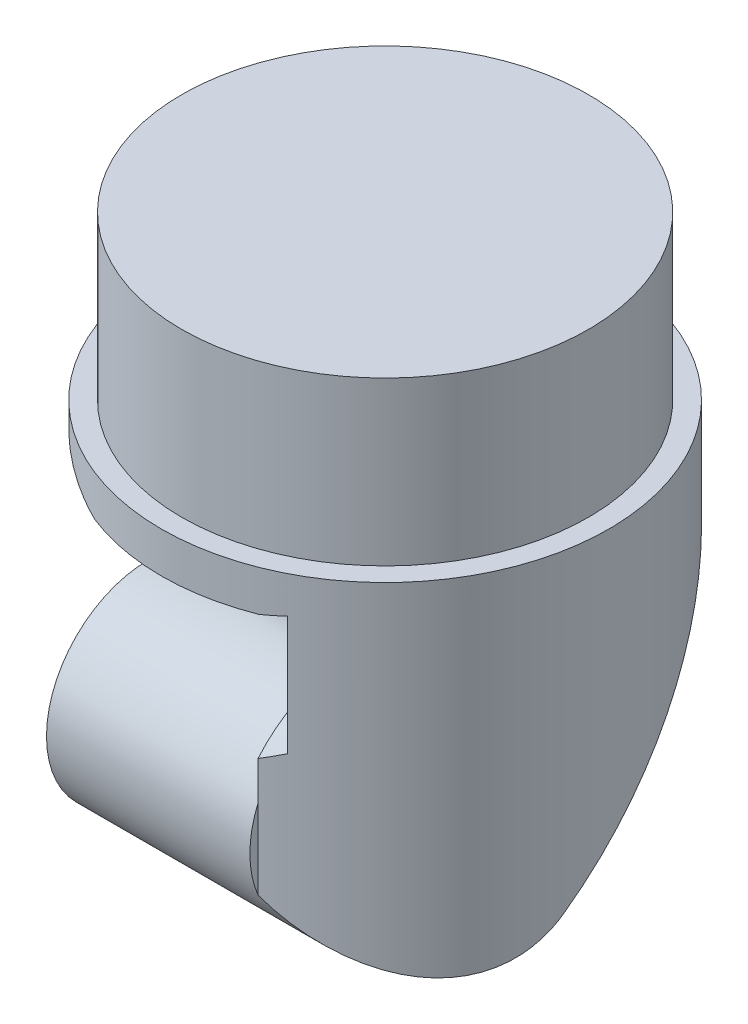
ISO-10303-21;
HEADER;
FILE_DESCRIPTION(('STEP AP214'),'2;1');
FILE_NAME('part.step','',(''),(''),'','','');
FILE_SCHEMA(('AUTOMOTIVE_DESIGN { 1 0 10303 214 1 1 1 1 }'));
ENDSEC;
DATA;
#1=APPLICATION_CONTEXT('core data for automotive mechanical design processes');
#2=APPLICATION_PROTOCOL_DEFINITION('international standard','automotive_design',2000,#1);
#3=PRODUCT_CONTEXT('',#1,'mechanical');
#4=PRODUCT('Part','Part','',(#3));
#5=PRODUCT_RELATED_PRODUCT_CATEGORY('part','',(#4));
#6=PRODUCT_DEFINITION_FORMATION('','',#4);
#7=PRODUCT_DEFINITION_CONTEXT('part definition',#1,'design');
#8=PRODUCT_DEFINITION('design','',#6,#7);
#9=PRODUCT_DEFINITION_SHAPE('','',#8);
#10=(LENGTH_UNIT() NAMED_UNIT(*) SI_UNIT(.MILLI.,.METRE.));
#11=(NAMED_UNIT(*) PLANE_ANGLE_UNIT() SI_UNIT($,.RADIAN.));
#12=(NAMED_UNIT(*) SI_UNIT($,.STERADIAN.) SOLID_ANGLE_UNIT());
#13=UNCERTAINTY_MEASURE_WITH_UNIT(LENGTH_MEASURE(1.E-05),#10,'distance_accuracy_value','');
#14=(GEOMETRIC_REPRESENTATION_CONTEXT(3) GLOBAL_UNCERTAINTY_ASSIGNED_CONTEXT((#13)) GLOBAL_UNIT_ASSIGNED_CONTEXT((#10,
#11,#12)) REPRESENTATION_CONTEXT('',''));
#15=CARTESIAN_POINT('',(0.,0.,0.));
#16=DIRECTION('',(0.,0.,1.));
#17=DIRECTION('',(1.,0.,0.));
#18=AXIS2_PLACEMENT_3D('',#15,#16,#17);
#19=CARTESIAN_POINT('',(0.,10.,0.));
#20=DIRECTION('',(0.,1.,0.));
#21=DIRECTION('',(0.,0.,1.));
#22=AXIS2_PLACEMENT_3D('',#19,#20,#21);
#23=CYLINDRICAL_SURFACE('',#22,5.5);
#24=CARTESIAN_POINT('',(0.,11.,0.));
#25=DIRECTION('',(0.,1.,0.));
#26=DIRECTION('',(0.,0.,1.));
#27=AXIS2_PLACEMENT_3D('',#24,#25,#26);
#28=CIRCLE('',#27,5.5);
#29=CARTESIAN_POINT('',(0.,11.,5.5));
#30=VERTEX_POINT('',#29);
#31=EDGE_CURVE('E243',#30,#30,#28,.T.);
#32=ORIENTED_EDGE('',*,*,#31,.F.);
#33=EDGE_LOOP('',(#32));
#34=FACE_BOUND('',#33,.T.);
#35=DIRECTION('',(0.,1.,0.));
#36=VECTOR('',#35,1.);
#37=CARTESIAN_POINT('',(2.5,10.,4.89897948556636));
#38=LINE('',#37,#36);
#39=CARTESIAN_POINT('',(2.5,10.0936873271116,4.89897948556636));
#40=VERTEX_POINT('',#39);
#41=CARTESIAN_POINT('',(2.5,7.16694498923648,4.89897948556636));
#42=VERTEX_POINT('',#41);
#43=EDGE_CURVE('E133',#40,#42,#38,.F.);
#44=ORIENTED_EDGE('',*,*,#43,.T.);
#45=CARTESIAN_POINT('',(2.5,7.16694498923648,4.89897948556636));
#46=CARTESIAN_POINT('',(2.45925598721561,7.14703912892889,4.91977108116387));
#47=CARTESIAN_POINT('',(2.41828211998175,7.12705867983323,4.94004032045465));
#48=CARTESIAN_POINT('',(2.33589147481019,7.08703747639836,4.97952788782191));
#49=CARTESIAN_POINT('',(2.29447493901794,7.0669967589463,4.99874675848738));
#50=CARTESIAN_POINT('',(2.2111732511241,7.02692295730909,5.03614907488732));
#51=CARTESIAN_POINT('',(2.16928809887176,7.00688987312639,5.05433252028873));
#52=CARTESIAN_POINT('',(2.08501704036061,6.96690876905985,5.08967496151173));
#53=CARTESIAN_POINT('',(2.04263088419465,6.94696079902124,5.10683341778357));
#54=CARTESIAN_POINT('',(2.,6.92710462120812,5.1234753829798));
#55=B_SPLINE_CURVE_WITH_KNOTS('',3,(#45,#46,#47,#48,#49,#50,#51,#52,#53,#54),.UNSPECIFIED.,.F.,
.F.,(4,2,2,2,4),(0.,0.149654235637309,0.299230419138411,0.448806650752238,0.598460937130687),.UNSPECIFIED.);
#56=CARTESIAN_POINT('',(2.,6.92710462120812,5.1234753829798));
#57=VERTEX_POINT('',#56);
#58=EDGE_CURVE('E166',#42,#57,#55,.T.);
#59=ORIENTED_EDGE('',*,*,#58,.T.);
#60=DIRECTION('',(0.,1.,0.));
#61=VECTOR('',#60,1.);
#62=CARTESIAN_POINT('',(2.,2.5,5.1234753829798));
#63=LINE('',#62,#61);
#64=CARTESIAN_POINT('',(2.,5.98169864066408,5.1234753829798));
#65=VERTEX_POINT('',#64);
#66=EDGE_CURVE('E125',#65,#57,#63,.T.);
#67=ORIENTED_EDGE('',*,*,#66,.F.);
#68=DIRECTION('',(0.,1.,0.));
#69=VECTOR('',#68,1.);
#70=CARTESIAN_POINT('',(2.,2.5,5.1234753829798));
#71=LINE('',#70,#69);
#72=CARTESIAN_POINT('',(2.,4.01830135933592,5.1234753829798));
#73=VERTEX_POINT('',#72);
#74=EDGE_CURVE('E195',#73,#65,#71,.T.);
#75=ORIENTED_EDGE('',*,*,#74,.F.);
#76=CARTESIAN_POINT('',(2.,4.01830135933592,5.1234753829798));
#77=CARTESIAN_POINT('',(2.0520121023461,3.97081184600082,5.10317961151804));
#78=CARTESIAN_POINT('',(2.10466473352652,3.92455261326593,5.08170628777884));
#79=CARTESIAN_POINT('',(2.21082294492664,3.83422853487849,5.03642427603247));
#80=CARTESIAN_POINT('',(2.26432834491247,3.79016323344603,5.01261607616378));
#81=CARTESIAN_POINT('',(2.37182114089697,3.70391309061592,4.96265925620459));
#82=CARTESIAN_POINT('',(2.42580882898598,3.66172949671099,4.93650911706318));
#83=CARTESIAN_POINT('',(2.53397167715478,3.57915479195713,4.8818704506749));
#84=CARTESIAN_POINT('',(2.58814684946937,3.53876380056137,4.85338176795451));
#85=CARTESIAN_POINT('',(2.75171697712417,3.41938525955828,4.76378061266119));
#86=CARTESIAN_POINT('',(2.86108335697951,3.34304321951705,4.69902638504962));
#87=CARTESIAN_POINT('',(3.07831395721625,3.19762515146659,4.55967544289563));
#88=CARTESIAN_POINT('',(3.18617867531005,3.12854666375361,4.48508207965968));
#89=CARTESIAN_POINT('',(3.37438667691193,3.01369066638822,4.34441101682515));
#90=CARTESIAN_POINT('',(3.45526985484804,2.96624078531022,4.28041804791778));
#91=CARTESIAN_POINT('',(3.61499221951131,2.87667908368489,4.14640781963944));
#92=CARTESIAN_POINT('',(3.69383150338769,2.83456700905252,4.07639084728374));
#93=CARTESIAN_POINT('',(3.84865389629679,2.75656011838206,3.93053828654509));
#94=CARTESIAN_POINT('',(3.92464549684633,2.72064543529278,3.8547224599004));
#95=CARTESIAN_POINT('',(4.07338478598405,2.65579867424649,3.69719859308611));
#96=CARTESIAN_POINT('',(4.14613337102933,2.62686465676455,3.61549219777975));
#97=CARTESIAN_POINT('',(4.32349999814032,2.5644435456329,3.4036510421814));
#98=CARTESIAN_POINT('',(4.42568065729982,2.53602344308696,3.26987972386732));
#99=CARTESIAN_POINT('',(4.6184067694868,2.50166787686435,2.9914685962761));
#100=CARTESIAN_POINT('',(4.70896382735247,2.49570981606252,2.84683985923107));
#101=CARTESIAN_POINT('',(4.86266363720734,2.50942872032696,2.5739207064272));
#102=CARTESIAN_POINT('',(4.92787879538119,2.52524007351472,2.44661520870865));
#103=CARTESIAN_POINT('',(5.046741790139,2.57804192512723,2.19094279173464));
#104=CARTESIAN_POINT('',(5.10039465726541,2.61502318719868,2.0625763594172));
#105=CARTESIAN_POINT('',(5.19572009656008,2.71135918597005,1.80911853617226));
#106=CARTESIAN_POINT('',(5.23734347692325,2.77080355802562,1.68404244228337));
#107=CARTESIAN_POINT('',(5.30878996404733,2.91150908539301,1.44310792867163));
#108=CARTESIAN_POINT('',(5.33861374825384,2.99276898776855,1.32724898007363));
#109=CARTESIAN_POINT('',(5.38627302751153,3.16852206047862,1.11751273614817));
#110=CARTESIAN_POINT('',(5.40480897093367,3.26166724640532,1.02265905854441));
#111=CARTESIAN_POINT('',(5.43487448860407,3.46248305273733,0.848507024305077));
#112=CARTESIAN_POINT('',(5.44640390177997,3.57015400700439,0.769209025305639));
#113=CARTESIAN_POINT('',(5.46450828399156,3.79824929599975,0.627929575460576));
#114=CARTESIAN_POINT('',(5.4710300634636,3.91879546204354,0.566138313960116));
#115=CARTESIAN_POINT('',(5.48074210187755,4.16839391427828,0.462786590747274));
#116=CARTESIAN_POINT('',(5.48393197588867,4.29744718145323,0.421228466839519));
#117=CARTESIAN_POINT('',(5.48838928467269,4.56432877202035,0.358622624370073));
#118=CARTESIAN_POINT('',(5.48959989706327,4.70230197539615,0.338187140200632));
#119=CARTESIAN_POINT('',(5.49066067733322,4.97973626582963,0.320506826700593));
#120=CARTESIAN_POINT('',(5.49051073679346,5.119197470578,0.323263845522439));
#121=CARTESIAN_POINT('',(5.48874178413259,5.39697269081984,0.352024287980783));
#122=CARTESIAN_POINT('',(5.48710952416477,5.53526498950838,0.378237312569402));
#123=CARTESIAN_POINT('',(5.48140460885704,5.8054698510478,0.453446359908798));
#124=CARTESIAN_POINT('',(5.47733183586814,5.93738210600675,0.502443480979214));
#125=CARTESIAN_POINT('',(5.46508775128994,6.19065577805727,0.621591081499012));
#126=CARTESIAN_POINT('',(5.45692748585514,6.31204460234463,0.691684347450708));
#127=CARTESIAN_POINT('',(5.43438566114513,6.54104780450643,0.850812970663726));
#128=CARTESIAN_POINT('',(5.42000538317617,6.64866501338413,0.939844424789315));
#129=CARTESIAN_POINT('',(5.38318518818132,6.84482811489809,1.13164752097222));
#130=CARTESIAN_POINT('',(5.36092060598035,6.93372661035177,1.23409187931157));
#131=CARTESIAN_POINT('',(5.30652822323819,7.09282989655711,1.45022097449946));
#132=CARTESIAN_POINT('',(5.27440358867859,7.16304067428881,1.56390209538415));
#133=CARTESIAN_POINT('',(5.20026182217657,7.28182731756178,1.79487683031511));
#134=CARTESIAN_POINT('',(5.15853296357643,7.33093269552427,1.91199191134318));
#135=CARTESIAN_POINT('',(5.06463442900662,7.41013303448276,2.14840812717182));
#136=CARTESIAN_POINT('',(5.01246310396729,7.44022498976366,2.26770960454048));
#137=CARTESIAN_POINT('',(4.89627817336472,7.48317393873218,2.50899106059221));
#138=CARTESIAN_POINT('',(4.83190587816689,7.49537151884175,2.63091286407813));
#139=CARTESIAN_POINT('',(4.69390473187341,7.50244465164925,2.86989909759627));
#140=CARTESIAN_POINT('',(4.62027191445891,7.49731275757164,2.98696141754587));
#141=CARTESIAN_POINT('',(4.48697610250427,7.47560608812503,3.18227578733768));
#142=CARTESIAN_POINT('',(4.42915825983943,7.46262918851517,3.26223281460293));
#143=CARTESIAN_POINT('',(4.31005246068323,7.42977039833765,3.41805131023414));
#144=CARTESIAN_POINT('',(4.24876329062628,7.40988608033042,3.49391132796512));
#145=CARTESIAN_POINT('',(4.06021423213746,7.34100294520247,3.71512766004203));
#146=CARTESIAN_POINT('',(3.92843465987049,7.2828044793812,3.8538852487387));
#147=CARTESIAN_POINT('',(3.70006470537728,7.16903966737324,4.07135766727));
#148=CARTESIAN_POINT('',(3.60560033846919,7.1185145670461,4.15514011248343));
#149=CARTESIAN_POINT('',(3.41375408402635,7.00987854551243,4.31413751136257));
#150=CARTESIAN_POINT('',(3.31637093710724,6.95176431238632,4.38934869751328));
#151=CARTESIAN_POINT('',(3.11963170077265,6.82891861747026,4.53129421940561));
#152=CARTESIAN_POINT('',(3.02027519382033,6.7641857429822,4.59802673859578));
#153=CARTESIAN_POINT('',(2.82050739667142,6.62869263541682,4.72319950823664));
#154=CARTESIAN_POINT('',(2.72009646309154,6.55793438605319,4.78164247106751));
#155=CARTESIAN_POINT('',(2.56732090792769,6.44575464389353,4.86440295454278));
#156=CARTESIAN_POINT('',(2.51494638625815,6.40648845046464,4.89167282868759));
#157=CARTESIAN_POINT('',(2.41040736105154,6.32627903206657,4.94402188329289));
#158=CARTESIAN_POINT('',(2.35824280466936,6.28533626236895,4.96910165275369));
#159=CARTESIAN_POINT('',(2.2545689683448,6.2018235730392,5.01698705386687));
#160=CARTESIAN_POINT('',(2.20305787308151,6.15926106135217,5.03980163883733));
#161=CARTESIAN_POINT('',(2.10083144889821,6.07208103636492,5.08326789170887));
#162=CARTESIAN_POINT('',(2.05011645412991,6.02746268952877,5.10391867098747));
#163=CARTESIAN_POINT('',(2.,5.98169864066408,5.1234753829798));
#164=B_SPLINE_CURVE_WITH_KNOTS('',3,(#76,#77,#78,#79,#80,#81,#82,#83,#84,#85,#86,#87,#88,#89,
#90,#91,#92,#93,#94,#95,#96,#97,#98,#99,#100,#101,#102,#103,#104,#105,#106,#107,#108,#109,#110,
#111,#112,#113,#114,#115,#116,#117,#118,#119,#120,#121,#122,#123,#124,#125,#126,#127,#128,#129,
#130,#131,#132,#133,#134,#135,#136,#137,#138,#139,#140,#141,#142,#143,#144,#145,#146,#147,#148,
#149,#150,#151,#152,#153,#154,#155,#156,#157,#158,#159,#160,#161,#162,#163),.UNSPECIFIED.,.F.,
.F.,(4,2,2,2,2,2,2,2,2,2,2,2,2,2,2,2,2,2,2,2,2,2,2,2,2,2,2,2,2,2,2,2,2,2,2,2,2,2,2,2,2,2,2,4),
(0.,0.219843913654683,0.439641963452114,0.659583627849797,0.879539926501751,1.32380750826896,
1.76792415700312,2.10823602717482,2.44853169206527,2.78771533946555,3.12680463845527,
3.63696069988687,4.14660340009105,4.57649437937514,5.0061979416025,5.43763458853796,
5.86904646197417,6.26984914697785,6.67066104564137,7.07567350769213,7.48073275514285,
7.89722871449102,8.31375786367287,8.73404666803513,9.15435573474613,9.57353502541831,
9.99262800734981,10.4029325805433,10.8131055458991,11.2122830076563,11.6115235571466,
12.0251358566051,12.4389259150548,12.7370996568197,13.0353782904775,13.6327858348749,
14.0403394813645,14.4480715835516,14.8558908954177,15.2635764576096,15.4762698174481,
15.6889057988556,15.9006647342348,16.1125102958076),.UNSPECIFIED.);
#165=CARTESIAN_POINT('',(5.40294893955143,3.2605384485999,1.02866066154008));
#166=VERTEX_POINT('',#165);
#167=EDGE_CURVE('E67',#73,#166,#164,.T.);
#168=ORIENTED_EDGE('',*,*,#167,.T.);
#169=CARTESIAN_POINT('',(0.,4.32241305616325,0.));
#170=DIRECTION('',(0.,0.695784620560041,0.718250486802563));
#171=DIRECTION('',(0.,0.718250486802563,-0.695784620560041));
#172=AXIS2_PLACEMENT_3D('',#169,#170,#171);
#173=ELLIPSE('',#172,7.90474499935486,5.5);
#174=CARTESIAN_POINT('',(2.5,9.37957341350427,-4.89897948556636));
#175=VERTEX_POINT('',#174);
#176=EDGE_CURVE('E199',#166,#175,#173,.T.);
#177=ORIENTED_EDGE('',*,*,#176,.T.);
#178=DIRECTION('',(0.,1.,0.));
#179=VECTOR('',#178,1.);
#180=CARTESIAN_POINT('',(2.5,10.,-4.89897948556636));
#181=LINE('',#180,#179);
#182=CARTESIAN_POINT('',(2.5,10.,-4.89897948556636));
#183=VERTEX_POINT('',#182);
#184=EDGE_CURVE('E248',#175,#183,#181,.T.);
#185=ORIENTED_EDGE('',*,*,#184,.T.);
#186=CARTESIAN_POINT('',(0.,10.,0.));
#187=DIRECTION('',(0.,1.,0.));
#188=DIRECTION('',(0.,0.,1.));
#189=AXIS2_PLACEMENT_3D('',#186,#187,#188);
#190=CIRCLE('',#189,5.5);
#191=CARTESIAN_POINT('',(-5.47411289917188,10.,0.53299903106857));
#192=VERTEX_POINT('',#191);
#193=EDGE_CURVE('E138',#183,#192,#190,.T.);
#194=ORIENTED_EDGE('',*,*,#193,.T.);
#195=CARTESIAN_POINT('',(-5.10681537111245,2.43725756519353,-2.04216472532693));
#196=CARTESIAN_POINT('',(-5.08020430604462,2.56356196505974,-2.10868132075415));
#197=CARTESIAN_POINT('',(-5.05405536695922,2.69255608499536,-2.17032735134272));
#198=CARTESIAN_POINT('',(-5.00392289693016,2.95539053976743,-2.28355559375387));
#199=CARTESIAN_POINT('',(-4.97994075268291,3.08923390231833,-2.33513138503554));
#200=CARTESIAN_POINT('',(-4.93537285230333,3.36135969588435,-2.42790925125743));
#201=CARTESIAN_POINT('',(-4.91479440513671,3.49965093710599,-2.46908909958056));
#202=CARTESIAN_POINT('',(-4.87823955649087,3.77959648121641,-2.54055019204561));
#203=CARTESIAN_POINT('',(-4.86226215779971,3.92125004815382,-2.57083379814882));
#204=CARTESIAN_POINT('',(-4.8357885402962,4.20769131780466,-2.62029447097012));
#205=CARTESIAN_POINT('',(-4.82531838861904,4.35249060666159,-2.63941876377057));
#206=CARTESIAN_POINT('',(-4.81063387237329,4.64348026091571,-2.66609007427546));
#207=CARTESIAN_POINT('',(-4.80641977304448,4.78967068502885,-2.67363660111423));
#208=CARTESIAN_POINT('',(-4.8045250016229,5.08191304576903,-2.67704004188268));
#209=CARTESIAN_POINT('',(-4.80683016951952,5.22796459434139,-2.67292229088259));
#210=CARTESIAN_POINT('',(-4.81779291382502,5.51902961494171,-2.65311099060148));
#211=CARTESIAN_POINT('',(-4.82645024214845,5.66404312728714,-2.6374178933988));
#212=CARTESIAN_POINT('',(-4.84879500105589,5.94229906714845,-2.59609266102515));
#213=CARTESIAN_POINT('',(-4.86210830760555,6.07568135349662,-2.57119347247858));
#214=CARTESIAN_POINT('',(-4.89307769511641,6.33978361682317,-2.5117531189474));
#215=CARTESIAN_POINT('',(-4.91073531221675,6.47050263433306,-2.47720854278985));
#216=CARTESIAN_POINT('',(-4.96897982604749,6.85788961526392,-2.35944479474898));
#217=CARTESIAN_POINT('',(-5.01482202720051,7.10960867539478,-2.26212257421958));
#218=CARTESIAN_POINT('',(-5.11650354952537,7.61648847258106,-2.02230845854569));
#219=CARTESIAN_POINT('',(-5.17286739594837,7.87000739474562,-1.87659847610155));
#220=CARTESIAN_POINT('',(-5.28098352809626,8.35143609934559,-1.54641202162763));
#221=CARTESIAN_POINT('',(-5.33273780216239,8.57935693470897,-1.36195238073326));
#222=CARTESIAN_POINT('',(-5.41560360534169,8.98307424785209,-0.977625219157533));
#223=CARTESIAN_POINT('',(-5.44827816763928,9.16181381486586,-0.781227061876756));
#224=CARTESIAN_POINT('',(-5.48107521792518,9.40789611837603,-0.467849215772096));
#225=CARTESIAN_POINT('',(-5.48930513099088,9.48626915052163,-0.360230690406007));
#226=CARTESIAN_POINT('',(-5.49934213138561,9.63511098202684,-0.139400534836147));
#227=CARTESIAN_POINT('',(-5.50115224644876,9.70558349227538,-0.026191566772717));
#228=CARTESIAN_POINT('',(-5.49737906292621,9.8386276194784,0.205941357842611));
#229=CARTESIAN_POINT('',(-5.49173336157139,9.90112768786096,0.324905419720983));
#230=CARTESIAN_POINT('',(-5.47208556150758,10.0170237682701,0.566539823951086));
#231=CARTESIAN_POINT('',(-5.45808342390724,10.0704197379241,0.689210183549627));
#232=CARTESIAN_POINT('',(-5.42106900012991,10.1677105788751,0.936841028597795));
#233=CARTESIAN_POINT('',(-5.39806319183114,10.2116122458669,1.06179980612253));
#234=CARTESIAN_POINT('',(-5.34261373963774,10.2898115444072,1.31261781863084));
#235=CARTESIAN_POINT('',(-5.31017135490256,10.3241104560915,1.43847693129511));
#236=CARTESIAN_POINT('',(-5.24076779771461,10.379195592279,1.67247108960312));
#237=CARTESIAN_POINT('',(-5.2050224016436,10.4011855150805,1.78068727373288));
#238=CARTESIAN_POINT('',(-5.12641486104944,10.4383286856045,1.99574014998995));
#239=CARTESIAN_POINT('',(-5.08355041779562,10.453479719165,2.10257638448496));
#240=CARTESIAN_POINT('',(-4.99090667131471,10.4773002259817,2.31390574041743));
#241=CARTESIAN_POINT('',(-4.94112917846329,10.4859713923913,2.41839946701233));
#242=CARTESIAN_POINT('',(-4.8349116319814,10.497331451411,2.62432063989886));
#243=CARTESIAN_POINT('',(-4.7784689711578,10.5000179948176,2.72574686666951));
#244=CARTESIAN_POINT('',(-4.65897896818806,10.4999817334464,2.9253217674607));
#245=CARTESIAN_POINT('',(-4.59589968591847,10.4972315196022,3.02345128474291));
#246=CARTESIAN_POINT('',(-4.46375700540589,10.4869222231001,3.21534833118504));
#247=CARTESIAN_POINT('',(-4.3946915089416,10.479361448362,3.30911431304383));
#248=CARTESIAN_POINT('',(-4.17913850316496,10.4504922047231,3.58311685890664));
#249=CARTESIAN_POINT('',(-4.02422277012943,10.4229952020377,3.75617742305803));
#250=CARTESIAN_POINT('',(-3.66924957482984,10.3520322500745,4.10587313923884));
#251=CARTESIAN_POINT('',(-3.46592470195342,10.3067342273302,4.27878483868033));
#252=CARTESIAN_POINT('',(-3.03704935905655,10.2103902290551,4.59315566997598));
#253=CARTESIAN_POINT('',(-2.81146985301762,10.1593367315289,4.73457290591256));
#254=CARTESIAN_POINT('',(-2.4401526321849,10.0809230584823,4.93148937001724));
#255=CARTESIAN_POINT('',(-2.30044749451627,10.0525779998852,4.99819562985277));
#256=CARTESIAN_POINT('',(-2.01549157112082,9.99853054546607,5.11974240101632));
#257=CARTESIAN_POINT('',(-1.87024278916417,9.97282720696067,5.17458715282773));
#258=CARTESIAN_POINT('',(-1.5751492464924,9.92565471759119,5.27190861088218));
#259=CARTESIAN_POINT('',(-1.425309263666,9.90418132686962,5.31439772227169));
#260=CARTESIAN_POINT('',(-1.12190024005986,9.8668389207465,5.38661735793425));
#261=CARTESIAN_POINT('',(-0.968331684668656,9.85096917999392,5.4163495336055));
#262=CARTESIAN_POINT('',(-0.664500662140752,9.82640935622664,5.46178878438238));
#263=CARTESIAN_POINT('',(-0.514331064397189,9.81747170381334,5.47798126811434));
#264=CARTESIAN_POINT('',(-0.212906196747802,9.80641698203324,5.49795267692685));
#265=CARTESIAN_POINT('',(-0.0616508893626007,9.80430014927132,5.50173117138324));
#266=CARTESIAN_POINT('',(0.240676806268429,9.80703837981312,5.49681190145337));
#267=CARTESIAN_POINT('',(0.391749051448715,9.81189721224604,5.48810739218571));
#268=CARTESIAN_POINT('',(0.6922458274278,9.82824887550451,5.45835117202347));
#269=CARTESIAN_POINT('',(0.841670782562247,9.83973995517377,5.43730272035838));
#270=CARTESIAN_POINT('',(1.16324240418514,9.87108196540106,5.3784722118344));
#271=CARTESIAN_POINT('',(1.33487672311458,9.89203082192907,5.33843470734912));
#272=CARTESIAN_POINT('',(1.58791336625386,9.92810457565738,5.26651755744414));
#273=CARTESIAN_POINT('',(1.67141279694265,9.94088376208905,5.24061151021068));
#274=CARTESIAN_POINT('',(1.83688082969412,9.96772852182612,5.1849280841318));
#275=CARTESIAN_POINT('',(1.91884975660574,9.98179381833009,5.15515153773085));
#276=CARTESIAN_POINT('',(2.,9.99637190580142,5.1234753829798));
#277=B_SPLINE_CURVE_WITH_KNOTS('',3,(#195,#196,#197,#198,#199,#200,#201,#202,#203,#204,#205,
#206,#207,#208,#209,#210,#211,#212,#213,#214,#215,#216,#217,#218,#219,#220,#221,#222,#223,#224,
#225,#226,#227,#228,#229,#230,#231,#232,#233,#234,#235,#236,#237,#238,#239,#240,#241,#242,#243,
#244,#245,#246,#247,#248,#249,#250,#251,#252,#253,#254,#255,#256,#257,#258,#259,#260,#261,#262,
#263,#264,#265,#266,#267,#268,#269,#270,#271,#272,#273,#274,#275,#276),.UNSPECIFIED.,.F.,.F.,(4,
2,2,2,2,2,2,2,2,2,2,2,2,2,2,2,2,2,2,2,2,2,2,2,2,2,2,2,2,2,2,2,2,2,2,2,2,2,2,2,4),(0.,
0.435555127145192,0.87138705333988,1.3081430475722,1.74480430977542,2.18351420818627,
2.62224270618453,3.06001900729658,3.49777821183941,3.90633174942853,4.31502995884403,
5.13296513216958,6.02278585582151,6.91222087696472,7.71129220753601,8.11102701843365,
8.51057327950509,8.91348489848849,9.31639839266151,9.71902253368035,10.1215929756043,
10.4693786386591,10.8172768203479,11.1650840663489,11.5130278165357,11.8627301767408,
12.2125556102908,12.9117927189973,13.7210699498596,14.5314173857799,15.0030970398564,
15.474607788922,15.9456434904817,16.4166181975842,16.8698803003826,17.3231581260522,
17.7766809614484,18.2300841049433,18.7614709139767,19.0264462634075,19.2913647174849),.UNSPECIFIED.);
#278=CARTESIAN_POINT('',(-2.02012257609788,10.,5.11557472602441));
#279=VERTEX_POINT('',#278);
#280=EDGE_CURVE('E120',#192,#279,#277,.T.);
#281=ORIENTED_EDGE('',*,*,#280,.T.);
#282=CARTESIAN_POINT('',(2.,10.,5.1234753829798));
#283=VERTEX_POINT('',#282);
#284=EDGE_CURVE('E277',#279,#283,#190,.T.);
#285=ORIENTED_EDGE('',*,*,#284,.T.);
#286=CARTESIAN_POINT('',(2.,9.99637190580142,5.1234753829798));
#287=VERTEX_POINT('',#286);
#288=EDGE_CURVE('E257',#287,#283,#63,.T.);
#289=ORIENTED_EDGE('',*,*,#288,.F.);
#290=CARTESIAN_POINT('',(2.5,10.0936873271116,4.89897948556636));
#291=CARTESIAN_POINT('',(2.45934208972774,10.0852363866161,4.91972763595864));
#292=CARTESIAN_POINT('',(2.41841640725252,10.0768419902032,4.93997448174322));
#293=CARTESIAN_POINT('',(2.33607334943016,10.0602138338329,4.97944219237584));
#294=CARTESIAN_POINT('',(2.29465629497016,10.0519799774231,4.99866368611325));
#295=CARTESIAN_POINT('',(2.21132373518859,10.0357098355774,5.03608314516317));
#296=CARTESIAN_POINT('',(2.16940822864348,10.0276735506266,5.05428110796261));
#297=CARTESIAN_POINT('',(2.08507204573807,10.0118352034207,5.08965292160145));
#298=CARTESIAN_POINT('',(2.04265107185794,10.0040332897028,5.10682612951016));
#299=CARTESIAN_POINT('',(2.,9.99637190580142,5.1234753829798));
#300=B_SPLINE_CURVE_WITH_KNOTS('',3,(#290,#291,#292,#293,#294,#295,#296,#297,#298,#299),
.UNSPECIFIED.,.F.,.F.,(4,2,2,2,4),(0.,0.139261698809938,0.278436976881686,0.417612596655242,
0.556874636414353),.UNSPECIFIED.);
#301=EDGE_CURVE('E157',#40,#287,#300,.T.);
#302=ORIENTED_EDGE('',*,*,#301,.F.);
#303=EDGE_LOOP('',(#44,#59,#67,#75,#168,#177,#185,#194,#281,#285,#289,#302));
#304=FACE_BOUND('',#303,.T.);
#305=ADVANCED_FACE('F43',(#34,#304),#23,.T.);
#306=CARTESIAN_POINT('',(5.50000000000001,3.2605384485999,1.02866066154008));
#307=DIRECTION('',(0.,0.695784620560041,0.718250486802563));
#308=DIRECTION('',(0.,-0.718250486802563,0.695784620560041));
#309=AXIS2_PLACEMENT_3D('',#306,#307,#308);
#310=PLANE('',#309);
#311=DIRECTION('',(-1.,0.,0.));
#312=VECTOR('',#311,1.);
#313=CARTESIAN_POINT('',(2.5,4.451622133707,-0.125167599108651));
#314=LINE('',#313,#312);
#315=CARTESIAN_POINT('',(2.5,4.451622133707,-0.125167599108651));
#316=VERTEX_POINT('',#315);
#317=CARTESIAN_POINT('',(2.,4.451622133707,-0.125167599108651));
#318=VERTEX_POINT('',#317);
#319=EDGE_CURVE('E149',#316,#318,#314,.T.);
#320=ORIENTED_EDGE('',*,*,#319,.F.);
#321=DIRECTION('',(0.,-0.718250486802563,0.695784620560041));
#322=VECTOR('',#321,1.);
#323=CARTESIAN_POINT('',(2.5,2.09255034873038,2.16011573441321));
#324=LINE('',#323,#322);
#325=EDGE_CURVE('E140',#175,#316,#324,.T.);
#326=ORIENTED_EDGE('',*,*,#325,.F.);
#327=ORIENTED_EDGE('',*,*,#176,.F.);
#328=DIRECTION('',(-1.,0.,0.));
#329=VECTOR('',#328,1.);
#330=CARTESIAN_POINT('',(5.50000000000001,3.2605384485999,1.02866066154008));
#331=LINE('',#330,#329);
#332=CARTESIAN_POINT('',(2.,3.2605384485999,1.02866066154008));
#333=VERTEX_POINT('',#332);
#334=EDGE_CURVE('E278',#166,#333,#331,.T.);
#335=ORIENTED_EDGE('',*,*,#334,.T.);
#336=DIRECTION('',(0.,-0.718250486802563,0.695784620560041));
#337=VECTOR('',#336,1.);
#338=CARTESIAN_POINT('',(2.,10.,-5.5));
#339=LINE('',#338,#337);
#340=EDGE_CURVE('E59',#318,#333,#339,.T.);
#341=ORIENTED_EDGE('',*,*,#340,.F.);
#342=EDGE_LOOP('',(#320,#326,#327,#335,#341));
#343=FACE_BOUND('',#342,.T.);
#344=ADVANCED_FACE('F217',(#343),#310,.F.);
#345=CARTESIAN_POINT('',(2.,5.,2.82428687854649));
#346=DIRECTION('',(-1.,0.,0.));
#347=DIRECTION('',(0.,0.,1.));
#348=AXIS2_PLACEMENT_3D('',#345,#346,#347);
#349=PLANE('',#348);
#350=ORIENTED_EDGE('',*,*,#66,.T.);
#351=CARTESIAN_POINT('',(2.,5.,2.82428687854649));
#352=DIRECTION('',(-1.,0.,0.));
#353=DIRECTION('',(0.,0.,1.));
#354=AXIS2_PLACEMENT_3D('',#351,#352,#353);
#355=CIRCLE('',#354,3.);
#356=EDGE_CURVE('E135',#57,#318,#355,.T.);
#357=ORIENTED_EDGE('',*,*,#356,.T.);
#358=ORIENTED_EDGE('',*,*,#340,.T.);
#359=CARTESIAN_POINT('',(2.,5.,2.82428687854649));
#360=DIRECTION('',(1.,0.,0.));
#361=DIRECTION('',(0.,0.,1.));
#362=AXIS2_PLACEMENT_3D('',#359,#360,#361);
#363=CIRCLE('',#362,2.5);
#364=EDGE_CURVE('E209',#333,#65,#363,.T.);
#365=ORIENTED_EDGE('',*,*,#364,.T.);
#366=EDGE_LOOP('',(#350,#357,#358,#365));
#367=FACE_BOUND('',#366,.T.);
#368=ADVANCED_FACE('F220',(#367),#349,.T.);
#369=CARTESIAN_POINT('',(2.,10.,5.5));
#370=DIRECTION('',(0.,1.,0.));
#371=DIRECTION('',(0.,0.,1.));
#372=AXIS2_PLACEMENT_3D('',#369,#370,#371);
#373=PLANE('',#372);
#374=DIRECTION('',(1.,0.,0.));
#375=VECTOR('',#374,1.);
#376=CARTESIAN_POINT('',(-8.,10.,5.11557472602441));
#377=LINE('',#376,#375);
#378=CARTESIAN_POINT('',(2.,10.,5.11557472602441));
#379=VERTEX_POINT('',#378);
#380=EDGE_CURVE('E14',#379,#279,#377,.F.);
#381=ORIENTED_EDGE('',*,*,#380,.F.);
#382=DIRECTION('',(0.,0.,-1.));
#383=VECTOR('',#382,1.);
#384=CARTESIAN_POINT('',(2.,10.,5.5));
#385=LINE('',#384,#383);
#386=EDGE_CURVE('E282',#283,#379,#385,.T.);
#387=ORIENTED_EDGE('',*,*,#386,.F.);
#388=ORIENTED_EDGE('',*,*,#284,.F.);
#389=EDGE_LOOP('',(#381,#387,#388));
#390=FACE_BOUND('',#389,.T.);
#391=ADVANCED_FACE('F222',(#390),#373,.F.);
#392=DIRECTION('',(1.,0.,0.));
#393=VECTOR('',#392,1.);
#394=CARTESIAN_POINT('',(-8.,10.,0.532999031068571));
#395=LINE('',#394,#393);
#396=CARTESIAN_POINT('',(2.5,10.,0.532999031068569));
#397=VERTEX_POINT('',#396);
#398=EDGE_CURVE('E52',#192,#397,#395,.T.);
#399=ORIENTED_EDGE('',*,*,#398,.F.);
#400=ORIENTED_EDGE('',*,*,#193,.F.);
#401=DIRECTION('',(0.,0.,-1.));
#402=VECTOR('',#401,1.);
#403=CARTESIAN_POINT('',(2.5,10.,0.));
#404=LINE('',#403,#402);
#405=EDGE_CURVE('E129',#397,#183,#404,.T.);
#406=ORIENTED_EDGE('',*,*,#405,.F.);
#407=EDGE_LOOP('',(#399,#400,#406));
#408=FACE_BOUND('',#407,.T.);
#409=ADVANCED_FACE('F137',(#408),#373,.F.);
#410=CARTESIAN_POINT('',(5.50000000000001,5.,2.82428687854649));
#411=DIRECTION('',(-1.,0.,0.));
#412=DIRECTION('',(0.,0.,1.));
#413=AXIS2_PLACEMENT_3D('',#410,#411,#412);
#414=CYLINDRICAL_SURFACE('',#413,2.5);
#415=CARTESIAN_POINT('',(-3.,5.,2.82428687854649));
#416=DIRECTION('',(-1.,0.,0.));
#417=DIRECTION('',(0.,0.,1.));
#418=AXIS2_PLACEMENT_3D('',#415,#416,#417);
#419=CIRCLE('',#418,2.5);
#420=CARTESIAN_POINT('',(-3.,5.,5.32428687854649));
#421=VERTEX_POINT('',#420);
#422=EDGE_CURVE('E208',#421,#421,#419,.T.);
#423=ORIENTED_EDGE('',*,*,#422,.F.);
#424=EDGE_LOOP('',(#423));
#425=FACE_BOUND('',#424,.T.);
#426=ORIENTED_EDGE('',*,*,#364,.F.);
#427=ORIENTED_EDGE('',*,*,#334,.F.);
#428=ORIENTED_EDGE('',*,*,#167,.F.);
#429=EDGE_CURVE('E264',#65,#73,#363,.T.);
#430=ORIENTED_EDGE('',*,*,#429,.F.);
#431=EDGE_LOOP('',(#426,#427,#428,#430));
#432=FACE_BOUND('',#431,.T.);
#433=ADVANCED_FACE('F211',(#425,#432),#414,.T.);
#434=CARTESIAN_POINT('',(2.,5.,2.82428687854649));
#435=DIRECTION('',(-1.,0.,0.));
#436=DIRECTION('',(0.,0.,1.));
#437=AXIS2_PLACEMENT_3D('',#434,#435,#436);
#438=CIRCLE('',#437,5.5);
#439=EDGE_CURVE('E150',#287,#379,#438,.T.);
#440=ORIENTED_EDGE('',*,*,#439,.F.);
#441=ORIENTED_EDGE('',*,*,#288,.T.);
#442=ORIENTED_EDGE('',*,*,#386,.T.);
#443=EDGE_LOOP('',(#440,#441,#442));
#444=FACE_BOUND('',#443,.T.);
#445=ADVANCED_FACE('F215',(#444),#349,.T.);
#446=CARTESIAN_POINT('',(0.,11.,0.));
#447=DIRECTION('',(0.,1.,0.));
#448=DIRECTION('',(0.,0.,1.));
#449=AXIS2_PLACEMENT_3D('',#446,#447,#448);
#450=PLANE('',#449);
#451=CARTESIAN_POINT('',(0.,11.,0.));
#452=DIRECTION('',(0.,1.,0.));
#453=DIRECTION('',(0.,0.,1.));
#454=AXIS2_PLACEMENT_3D('',#451,#452,#453);
#455=CIRCLE('',#454,5.);
#456=CARTESIAN_POINT('',(0.,11.,5.));
#457=VERTEX_POINT('',#456);
#458=EDGE_CURVE('E267',#457,#457,#455,.T.);
#459=ORIENTED_EDGE('',*,*,#458,.F.);
#460=EDGE_LOOP('',(#459));
#461=FACE_BOUND('',#460,.T.);
#462=ORIENTED_EDGE('',*,*,#31,.T.);
#463=EDGE_LOOP('',(#462));
#464=FACE_BOUND('',#463,.T.);
#465=ADVANCED_FACE('F228',(#461,#464),#450,.T.);
#466=CARTESIAN_POINT('',(0.,11.,0.));
#467=DIRECTION('',(0.,1.,0.));
#468=DIRECTION('',(0.,0.,1.));
#469=AXIS2_PLACEMENT_3D('',#466,#467,#468);
#470=CYLINDRICAL_SURFACE('',#469,5.);
#471=ORIENTED_EDGE('',*,*,#458,.T.);
#472=EDGE_LOOP('',(#471));
#473=FACE_BOUND('',#472,.T.);
#474=CARTESIAN_POINT('',(0.,15.,0.));
#475=DIRECTION('',(0.,1.,0.));
#476=DIRECTION('',(0.,0.,1.));
#477=AXIS2_PLACEMENT_3D('',#474,#475,#476);
#478=CIRCLE('',#477,5.);
#479=CARTESIAN_POINT('',(0.,15.,5.));
#480=VERTEX_POINT('',#479);
#481=EDGE_CURVE('E268',#480,#480,#478,.T.);
#482=ORIENTED_EDGE('',*,*,#481,.F.);
#483=EDGE_LOOP('',(#482));
#484=FACE_BOUND('',#483,.T.);
#485=ADVANCED_FACE('F297',(#473,#484),#470,.T.);
#486=CARTESIAN_POINT('',(0.,15.,0.));
#487=DIRECTION('',(0.,1.,0.));
#488=DIRECTION('',(0.,0.,1.));
#489=AXIS2_PLACEMENT_3D('',#486,#487,#488);
#490=PLANE('',#489);
#491=ORIENTED_EDGE('',*,*,#481,.T.);
#492=EDGE_LOOP('',(#491));
#493=FACE_BOUND('',#492,.T.);
#494=ADVANCED_FACE('F45',(#493),#490,.T.);
#495=CARTESIAN_POINT('',(-3.,5.,2.82428687854649));
#496=DIRECTION('',(-1.,0.,0.));
#497=DIRECTION('',(0.,0.,1.));
#498=AXIS2_PLACEMENT_3D('',#495,#496,#497);
#499=PLANE('',#498);
#500=ORIENTED_EDGE('',*,*,#422,.T.);
#501=EDGE_LOOP('',(#500));
#502=FACE_BOUND('',#501,.T.);
#503=ADVANCED_FACE('F230',(#502),#499,.T.);
#504=CARTESIAN_POINT('',(2.,2.5,5.5));
#505=DIRECTION('',(1.,0.,0.));
#506=DIRECTION('',(0.,0.,-1.));
#507=AXIS2_PLACEMENT_3D('',#504,#505,#506);
#508=PLANE('',#507);
#509=ORIENTED_EDGE('',*,*,#429,.T.);
#510=ORIENTED_EDGE('',*,*,#74,.T.);
#511=EDGE_LOOP('',(#509,#510));
#512=FACE_BOUND('',#511,.T.);
#513=ADVANCED_FACE('F184',(#512),#508,.T.);
#514=CARTESIAN_POINT('',(-8.,5.,2.82428687854649));
#515=DIRECTION('',(1.,0.,0.));
#516=DIRECTION('',(0.,0.,-1.));
#517=AXIS2_PLACEMENT_3D('',#514,#515,#516);
#518=CYLINDRICAL_SURFACE('',#517,5.5);
#519=ORIENTED_EDGE('',*,*,#380,.T.);
#520=ORIENTED_EDGE('',*,*,#280,.F.);
#521=ORIENTED_EDGE('',*,*,#398,.T.);
#522=CARTESIAN_POINT('',(2.5,5.,2.82428687854649));
#523=DIRECTION('',(-1.,0.,0.));
#524=DIRECTION('',(0.,0.,1.));
#525=AXIS2_PLACEMENT_3D('',#522,#523,#524);
#526=CIRCLE('',#525,5.5);
#527=EDGE_CURVE('E117',#40,#397,#526,.T.);
#528=ORIENTED_EDGE('',*,*,#527,.F.);
#529=ORIENTED_EDGE('',*,*,#301,.T.);
#530=ORIENTED_EDGE('',*,*,#439,.T.);
#531=EDGE_LOOP('',(#519,#520,#521,#528,#529,#530));
#532=FACE_BOUND('',#531,.T.);
#533=ADVANCED_FACE('F116',(#532),#518,.F.);
#534=CARTESIAN_POINT('',(2.5,5.,2.82428687854649));
#535=DIRECTION('',(-1.,0.,0.));
#536=DIRECTION('',(0.,0.,1.));
#537=AXIS2_PLACEMENT_3D('',#534,#535,#536);
#538=CYLINDRICAL_SURFACE('',#537,3.);
#539=CARTESIAN_POINT('',(2.5,5.,2.82428687854649));
#540=DIRECTION('',(-1.,0.,0.));
#541=DIRECTION('',(0.,0.,1.));
#542=AXIS2_PLACEMENT_3D('',#539,#540,#541);
#543=CIRCLE('',#542,3.);
#544=EDGE_CURVE('E144',#42,#316,#543,.T.);
#545=ORIENTED_EDGE('',*,*,#544,.T.);
#546=ORIENTED_EDGE('',*,*,#319,.T.);
#547=ORIENTED_EDGE('',*,*,#356,.F.);
#548=ORIENTED_EDGE('',*,*,#58,.F.);
#549=EDGE_LOOP('',(#545,#546,#547,#548));
#550=FACE_BOUND('',#549,.T.);
#551=ADVANCED_FACE('F178',(#550),#538,.T.);
#552=CARTESIAN_POINT('',(2.5,0.,0.));
#553=DIRECTION('',(-1.,0.,0.));
#554=DIRECTION('',(0.,0.,1.));
#555=AXIS2_PLACEMENT_3D('',#552,#553,#554);
#556=PLANE('',#555);
#557=ORIENTED_EDGE('',*,*,#527,.T.);
#558=ORIENTED_EDGE('',*,*,#405,.T.);
#559=ORIENTED_EDGE('',*,*,#184,.F.);
#560=ORIENTED_EDGE('',*,*,#325,.T.);
#561=ORIENTED_EDGE('',*,*,#544,.F.);
#562=ORIENTED_EDGE('',*,*,#43,.F.);
#563=EDGE_LOOP('',(#557,#558,#559,#560,#561,#562));
#564=FACE_BOUND('',#563,.T.);
#565=ADVANCED_FACE('F128',(#564),#556,.T.);
#566=CLOSED_SHELL('',(#305,#344,#368,#391,#409,#433,#445,#465,#485,#494,#503,#513,#533,#551,#565));
#567=MANIFOLD_SOLID_BREP('B2',#566);
#568=ADVANCED_BREP_SHAPE_REPRESENTATION('',(#18,#567),#14);
#569=SHAPE_DEFINITION_REPRESENTATION(#9,#568);
ENDSEC;
END-ISO-10303-21;
